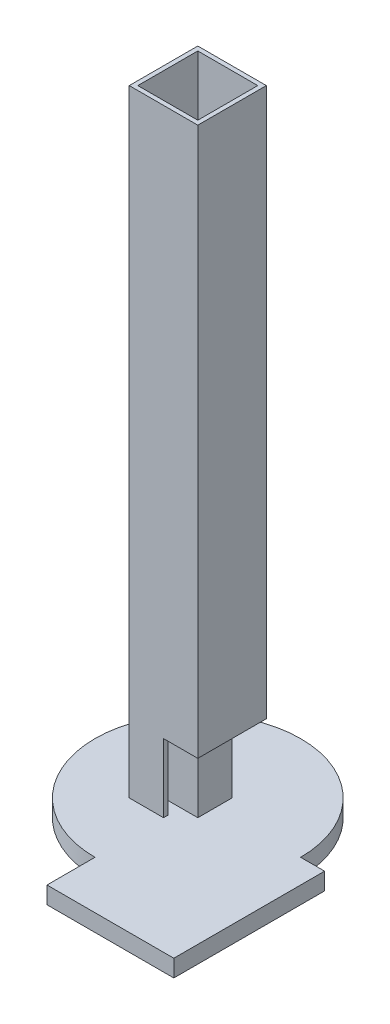
ISO-10303-21;
HEADER;
FILE_DESCRIPTION(('STEP AP214'),'2;1');
FILE_NAME('part.step','',(''),(''),'','','');
FILE_SCHEMA(('AUTOMOTIVE_DESIGN { 1 0 10303 214 1 1 1 1 }'));
ENDSEC;
DATA;
#1=APPLICATION_CONTEXT('core data for automotive mechanical design processes');
#2=APPLICATION_PROTOCOL_DEFINITION('international standard','automotive_design',2000,#1);
#3=PRODUCT_CONTEXT('',#1,'mechanical');
#4=PRODUCT('Part','Part','',(#3));
#5=PRODUCT_RELATED_PRODUCT_CATEGORY('part','',(#4));
#6=PRODUCT_DEFINITION_FORMATION('','',#4);
#7=PRODUCT_DEFINITION_CONTEXT('part definition',#1,'design');
#8=PRODUCT_DEFINITION('design','',#6,#7);
#9=PRODUCT_DEFINITION_SHAPE('','',#8);
#10=(LENGTH_UNIT() NAMED_UNIT(*) SI_UNIT(.MILLI.,.METRE.));
#11=(NAMED_UNIT(*) PLANE_ANGLE_UNIT() SI_UNIT($,.RADIAN.));
#12=(NAMED_UNIT(*) SI_UNIT($,.STERADIAN.) SOLID_ANGLE_UNIT());
#13=UNCERTAINTY_MEASURE_WITH_UNIT(LENGTH_MEASURE(1.E-05),#10,'distance_accuracy_value','');
#14=(GEOMETRIC_REPRESENTATION_CONTEXT(3) GLOBAL_UNCERTAINTY_ASSIGNED_CONTEXT((#13)) GLOBAL_UNIT_ASSIGNED_CONTEXT((#10,
#11,#12)) REPRESENTATION_CONTEXT('',''));
#15=CARTESIAN_POINT('',(0.,0.,0.));
#16=DIRECTION('',(0.,0.,1.));
#17=DIRECTION('',(1.,0.,0.));
#18=AXIS2_PLACEMENT_3D('',#15,#16,#17);
#19=CARTESIAN_POINT('',(0.,6.35,0.));
#20=DIRECTION('',(0.,1.,0.));
#21=DIRECTION('',(0.,0.,1.));
#22=AXIS2_PLACEMENT_3D('',#19,#20,#21);
#23=PLANE('',#22);
#24=DIRECTION('',(-1.,0.,0.));
#25=VECTOR('',#24,1.);
#26=CARTESIAN_POINT('',(-11.1125,6.35,11.1125));
#27=LINE('',#26,#25);
#28=CARTESIAN_POINT('',(0.,6.35,11.1125));
#29=VERTEX_POINT('',#28);
#30=CARTESIAN_POINT('',(-11.1125,6.35,11.1125));
#31=VERTEX_POINT('',#30);
#32=EDGE_CURVE('E292',#29,#31,#27,.T.);
#33=ORIENTED_EDGE('',*,*,#32,.F.);
#34=DIRECTION('',(0.,0.,1.));
#35=VECTOR('',#34,1.);
#36=CARTESIAN_POINT('',(0.,6.35,-12.7));
#37=LINE('',#36,#35);
#38=CARTESIAN_POINT('',(0.,6.35,12.7));
#39=VERTEX_POINT('',#38);
#40=EDGE_CURVE('E270',#29,#39,#37,.T.);
#41=ORIENTED_EDGE('',*,*,#40,.T.);
#42=DIRECTION('',(1.,0.,0.));
#43=VECTOR('',#42,1.);
#44=CARTESIAN_POINT('',(-12.7,6.35,12.7));
#45=LINE('',#44,#43);
#46=CARTESIAN_POINT('',(-12.7,6.35,12.7));
#47=VERTEX_POINT('',#46);
#48=EDGE_CURVE('E318',#47,#39,#45,.T.);
#49=ORIENTED_EDGE('',*,*,#48,.F.);
#50=DIRECTION('',(0.,0.,1.));
#51=VECTOR('',#50,1.);
#52=CARTESIAN_POINT('',(-12.7,6.35,12.7));
#53=LINE('',#52,#51);
#54=CARTESIAN_POINT('',(-12.7,6.35,-12.7));
#55=VERTEX_POINT('',#54);
#56=EDGE_CURVE('E326',#55,#47,#53,.T.);
#57=ORIENTED_EDGE('',*,*,#56,.F.);
#58=DIRECTION('',(-1.,0.,0.));
#59=VECTOR('',#58,1.);
#60=CARTESIAN_POINT('',(-12.7,6.35,-12.7));
#61=LINE('',#60,#59);
#62=CARTESIAN_POINT('',(0.,6.35,-12.7));
#63=VERTEX_POINT('',#62);
#64=EDGE_CURVE('E313',#63,#55,#61,.T.);
#65=ORIENTED_EDGE('',*,*,#64,.F.);
#66=CARTESIAN_POINT('',(0.,6.35,-11.1125));
#67=VERTEX_POINT('',#66);
#68=EDGE_CURVE('E266',#63,#67,#37,.T.);
#69=ORIENTED_EDGE('',*,*,#68,.T.);
#70=DIRECTION('',(-1.,0.,0.));
#71=VECTOR('',#70,1.);
#72=CARTESIAN_POINT('',(-11.1125,6.35,-11.1125));
#73=LINE('',#72,#71);
#74=CARTESIAN_POINT('',(-11.1125,6.35,-11.1125));
#75=VERTEX_POINT('',#74);
#76=EDGE_CURVE('E286',#67,#75,#73,.T.);
#77=ORIENTED_EDGE('',*,*,#76,.T.);
#78=DIRECTION('',(0.,0.,1.));
#79=VECTOR('',#78,1.);
#80=CARTESIAN_POINT('',(-11.1125,6.35,11.1125));
#81=LINE('',#80,#79);
#82=EDGE_CURVE('E288',#75,#31,#81,.T.);
#83=ORIENTED_EDGE('',*,*,#82,.T.);
#84=EDGE_LOOP('',(#33,#41,#49,#57,#65,#69,#77,#83));
#85=FACE_BOUND('',#84,.T.);
#86=CARTESIAN_POINT('',(0.,6.35,0.));
#87=DIRECTION('',(0.,1.,0.));
#88=DIRECTION('',(0.,0.,1.));
#89=AXIS2_PLACEMENT_3D('',#86,#87,#88);
#90=CIRCLE('',#89,38.1);
#91=CARTESIAN_POINT('',(38.1,6.35,0.));
#92=VERTEX_POINT('',#91);
#93=CARTESIAN_POINT('',(0.,6.35,38.1));
#94=VERTEX_POINT('',#93);
#95=EDGE_CURVE('E49',#92,#94,#90,.T.);
#96=ORIENTED_EDGE('',*,*,#95,.T.);
#97=DIRECTION('',(0.,0.,-1.));
#98=VECTOR('',#97,1.);
#99=CARTESIAN_POINT('',(0.,6.35,0.));
#100=LINE('',#99,#98);
#101=CARTESIAN_POINT('',(0.,6.35,55.88));
#102=VERTEX_POINT('',#101);
#103=EDGE_CURVE('E192',#102,#94,#100,.T.);
#104=ORIENTED_EDGE('',*,*,#103,.F.);
#105=DIRECTION('',(-1.,0.,0.));
#106=VECTOR('',#105,1.);
#107=CARTESIAN_POINT('',(0.,6.35,55.88));
#108=LINE('',#107,#106);
#109=CARTESIAN_POINT('',(46.99,6.35,55.88));
#110=VERTEX_POINT('',#109);
#111=EDGE_CURVE('E201',#110,#102,#108,.T.);
#112=ORIENTED_EDGE('',*,*,#111,.F.);
#113=DIRECTION('',(0.,0.,1.));
#114=VECTOR('',#113,1.);
#115=CARTESIAN_POINT('',(46.99,6.35,0.));
#116=LINE('',#115,#114);
#117=CARTESIAN_POINT('',(46.99,6.35,0.));
#118=VERTEX_POINT('',#117);
#119=EDGE_CURVE('E191',#118,#110,#116,.T.);
#120=ORIENTED_EDGE('',*,*,#119,.F.);
#121=DIRECTION('',(1.,0.,0.));
#122=VECTOR('',#121,1.);
#123=CARTESIAN_POINT('',(0.,6.35,0.));
#124=LINE('',#123,#122);
#125=EDGE_CURVE('E182',#92,#118,#124,.T.);
#126=ORIENTED_EDGE('',*,*,#125,.F.);
#127=EDGE_LOOP('',(#96,#104,#112,#120,#126));
#128=FACE_BOUND('',#127,.T.);
#129=DIRECTION('',(0.,0.,-1.));
#130=VECTOR('',#129,1.);
#131=CARTESIAN_POINT('',(6.35,6.35,6.35));
#132=LINE('',#131,#130);
#133=CARTESIAN_POINT('',(6.35,6.35,6.35));
#134=VERTEX_POINT('',#133);
#135=CARTESIAN_POINT('',(6.35,6.35,-6.35));
#136=VERTEX_POINT('',#135);
#137=EDGE_CURVE('E224',#134,#136,#132,.T.);
#138=ORIENTED_EDGE('',*,*,#137,.F.);
#139=DIRECTION('',(1.,0.,0.));
#140=VECTOR('',#139,1.);
#141=CARTESIAN_POINT('',(-6.35,6.35,6.35));
#142=LINE('',#141,#140);
#143=CARTESIAN_POINT('',(-6.35,6.35,6.35));
#144=VERTEX_POINT('',#143);
#145=EDGE_CURVE('E229',#144,#134,#142,.T.);
#146=ORIENTED_EDGE('',*,*,#145,.F.);
#147=DIRECTION('',(0.,0.,1.));
#148=VECTOR('',#147,1.);
#149=CARTESIAN_POINT('',(-6.35,6.35,6.35));
#150=LINE('',#149,#148);
#151=CARTESIAN_POINT('',(-6.35,6.35,-6.35));
#152=VERTEX_POINT('',#151);
#153=EDGE_CURVE('E239',#152,#144,#150,.T.);
#154=ORIENTED_EDGE('',*,*,#153,.F.);
#155=DIRECTION('',(-1.,0.,0.));
#156=VECTOR('',#155,1.);
#157=CARTESIAN_POINT('',(-6.35,6.35,-6.35));
#158=LINE('',#157,#156);
#159=EDGE_CURVE('E237',#136,#152,#158,.T.);
#160=ORIENTED_EDGE('',*,*,#159,.F.);
#161=EDGE_LOOP('',(#138,#146,#154,#160));
#162=FACE_BOUND('',#161,.T.);
#163=ADVANCED_FACE('F41',(#85,#128,#162),#23,.T.);
#164=CARTESIAN_POINT('',(0.,234.95,0.));
#165=DIRECTION('',(0.,-1.,0.));
#166=DIRECTION('',(0.,0.,-1.));
#167=AXIS2_PLACEMENT_3D('',#164,#165,#166);
#168=PLANE('',#167);
#169=DIRECTION('',(0.,0.,-1.));
#170=VECTOR('',#169,1.);
#171=CARTESIAN_POINT('',(12.7,234.95,12.7));
#172=LINE('',#171,#170);
#173=CARTESIAN_POINT('',(12.7,234.95,12.7));
#174=VERTEX_POINT('',#173);
#175=CARTESIAN_POINT('',(12.7,234.95,-12.7));
#176=VERTEX_POINT('',#175);
#177=EDGE_CURVE('E314',#174,#176,#172,.T.);
#178=ORIENTED_EDGE('',*,*,#177,.T.);
#179=DIRECTION('',(-1.,0.,0.));
#180=VECTOR('',#179,1.);
#181=CARTESIAN_POINT('',(-12.7,234.95,-12.7));
#182=LINE('',#181,#180);
#183=CARTESIAN_POINT('',(-12.7,234.95,-12.7));
#184=VERTEX_POINT('',#183);
#185=EDGE_CURVE('E317',#176,#184,#182,.T.);
#186=ORIENTED_EDGE('',*,*,#185,.T.);
#187=DIRECTION('',(0.,0.,1.));
#188=VECTOR('',#187,1.);
#189=CARTESIAN_POINT('',(-12.7,234.95,12.7));
#190=LINE('',#189,#188);
#191=CARTESIAN_POINT('',(-12.7,234.95,12.7));
#192=VERTEX_POINT('',#191);
#193=EDGE_CURVE('E320',#184,#192,#190,.T.);
#194=ORIENTED_EDGE('',*,*,#193,.T.);
#195=DIRECTION('',(1.,0.,0.));
#196=VECTOR('',#195,1.);
#197=CARTESIAN_POINT('',(-12.7,234.95,12.7));
#198=LINE('',#197,#196);
#199=EDGE_CURVE('E322',#192,#174,#198,.T.);
#200=ORIENTED_EDGE('',*,*,#199,.T.);
#201=EDGE_LOOP('',(#178,#186,#194,#200));
#202=FACE_BOUND('',#201,.T.);
#203=DIRECTION('',(0.,0.,-1.));
#204=VECTOR('',#203,1.);
#205=CARTESIAN_POINT('',(-11.1125,234.95,11.1125));
#206=LINE('',#205,#204);
#207=CARTESIAN_POINT('',(-11.1125,234.95,11.1125));
#208=VERTEX_POINT('',#207);
#209=CARTESIAN_POINT('',(-11.1125,234.95,-11.1125));
#210=VERTEX_POINT('',#209);
#211=EDGE_CURVE('E285',#208,#210,#206,.T.);
#212=ORIENTED_EDGE('',*,*,#211,.T.);
#213=DIRECTION('',(1.,0.,0.));
#214=VECTOR('',#213,1.);
#215=CARTESIAN_POINT('',(-11.1125,234.95,-11.1125));
#216=LINE('',#215,#214);
#217=CARTESIAN_POINT('',(11.1125,234.95,-11.1125));
#218=VERTEX_POINT('',#217);
#219=EDGE_CURVE('E295',#210,#218,#216,.T.);
#220=ORIENTED_EDGE('',*,*,#219,.T.);
#221=DIRECTION('',(0.,0.,-1.));
#222=VECTOR('',#221,1.);
#223=CARTESIAN_POINT('',(11.1125,234.95,11.1125));
#224=LINE('',#223,#222);
#225=CARTESIAN_POINT('',(11.1125,234.95,11.1125));
#226=VERTEX_POINT('',#225);
#227=EDGE_CURVE('E298',#226,#218,#224,.T.);
#228=ORIENTED_EDGE('',*,*,#227,.F.);
#229=DIRECTION('',(1.,0.,0.));
#230=VECTOR('',#229,1.);
#231=CARTESIAN_POINT('',(-11.1125,234.95,11.1125));
#232=LINE('',#231,#230);
#233=EDGE_CURVE('E301',#208,#226,#232,.T.);
#234=ORIENTED_EDGE('',*,*,#233,.F.);
#235=EDGE_LOOP('',(#212,#220,#228,#234));
#236=FACE_BOUND('',#235,.T.);
#237=ADVANCED_FACE('F361',(#202,#236),#168,.F.);
#238=CARTESIAN_POINT('',(0.,6.35,0.));
#239=DIRECTION('',(0.,-1.,0.));
#240=DIRECTION('',(0.,0.,-1.));
#241=AXIS2_PLACEMENT_3D('',#238,#239,#240);
#242=CYLINDRICAL_SURFACE('',#241,38.1);
#243=CARTESIAN_POINT('',(0.,0.,0.));
#244=DIRECTION('',(0.,1.,0.));
#245=DIRECTION('',(0.,0.,1.));
#246=AXIS2_PLACEMENT_3D('',#243,#244,#245);
#247=CIRCLE('',#246,38.1);
#248=CARTESIAN_POINT('',(38.1,0.,0.));
#249=VERTEX_POINT('',#248);
#250=CARTESIAN_POINT('',(0.,0.,38.1));
#251=VERTEX_POINT('',#250);
#252=EDGE_CURVE('E342',#249,#251,#247,.T.);
#253=ORIENTED_EDGE('',*,*,#252,.T.);
#254=DIRECTION('',(0.,-1.,0.));
#255=VECTOR('',#254,1.);
#256=CARTESIAN_POINT('',(0.,6.35,38.1));
#257=LINE('',#256,#255);
#258=EDGE_CURVE('E60',#251,#94,#257,.F.);
#259=ORIENTED_EDGE('',*,*,#258,.T.);
#260=ORIENTED_EDGE('',*,*,#95,.F.);
#261=DIRECTION('',(0.,-1.,0.));
#262=VECTOR('',#261,1.);
#263=CARTESIAN_POINT('',(38.1,6.35,0.));
#264=LINE('',#263,#262);
#265=EDGE_CURVE('E188',#92,#249,#264,.T.);
#266=ORIENTED_EDGE('',*,*,#265,.T.);
#267=EDGE_LOOP('',(#253,#259,#260,#266));
#268=FACE_BOUND('',#267,.T.);
#269=ADVANCED_FACE('F43',(#268),#242,.T.);
#270=CARTESIAN_POINT('',(0.,0.,0.));
#271=DIRECTION('',(0.,1.,0.));
#272=DIRECTION('',(0.,0.,1.));
#273=AXIS2_PLACEMENT_3D('',#270,#271,#272);
#274=PLANE('',#273);
#275=ORIENTED_EDGE('',*,*,#252,.F.);
#276=DIRECTION('',(1.,0.,0.));
#277=VECTOR('',#276,1.);
#278=CARTESIAN_POINT('',(0.,0.,0.));
#279=LINE('',#278,#277);
#280=CARTESIAN_POINT('',(46.99,0.,0.));
#281=VERTEX_POINT('',#280);
#282=EDGE_CURVE('E213',#249,#281,#279,.T.);
#283=ORIENTED_EDGE('',*,*,#282,.T.);
#284=DIRECTION('',(0.,0.,1.));
#285=VECTOR('',#284,1.);
#286=CARTESIAN_POINT('',(46.99,0.,0.));
#287=LINE('',#286,#285);
#288=CARTESIAN_POINT('',(46.99,0.,55.88));
#289=VERTEX_POINT('',#288);
#290=EDGE_CURVE('E199',#281,#289,#287,.T.);
#291=ORIENTED_EDGE('',*,*,#290,.T.);
#292=DIRECTION('',(-1.,0.,0.));
#293=VECTOR('',#292,1.);
#294=CARTESIAN_POINT('',(0.,0.,55.88));
#295=LINE('',#294,#293);
#296=CARTESIAN_POINT('',(0.,0.,55.88));
#297=VERTEX_POINT('',#296);
#298=EDGE_CURVE('E216',#289,#297,#295,.T.);
#299=ORIENTED_EDGE('',*,*,#298,.T.);
#300=DIRECTION('',(0.,0.,-1.));
#301=VECTOR('',#300,1.);
#302=CARTESIAN_POINT('',(0.,0.,0.));
#303=LINE('',#302,#301);
#304=EDGE_CURVE('E210',#297,#251,#303,.T.);
#305=ORIENTED_EDGE('',*,*,#304,.T.);
#306=EDGE_LOOP('',(#275,#283,#291,#299,#305));
#307=FACE_BOUND('',#306,.T.);
#308=ADVANCED_FACE('F348',(#307),#274,.F.);
#309=CARTESIAN_POINT('',(12.7,234.95,12.7));
#310=DIRECTION('',(-1.,0.,0.));
#311=DIRECTION('',(0.,0.,1.));
#312=AXIS2_PLACEMENT_3D('',#309,#310,#311);
#313=PLANE('',#312);
#314=DIRECTION('',(0.,-1.,0.));
#315=VECTOR('',#314,1.);
#316=CARTESIAN_POINT('',(12.7,234.95,12.7));
#317=LINE('',#316,#315);
#318=CARTESIAN_POINT('',(12.7,31.75,12.7));
#319=VERTEX_POINT('',#318);
#320=EDGE_CURVE('E324',#174,#319,#317,.T.);
#321=ORIENTED_EDGE('',*,*,#320,.T.);
#322=DIRECTION('',(0.,0.,1.));
#323=VECTOR('',#322,1.);
#324=CARTESIAN_POINT('',(12.7,31.75,-12.7));
#325=LINE('',#324,#323);
#326=CARTESIAN_POINT('',(12.7,31.75,-12.7));
#327=VERTEX_POINT('',#326);
#328=EDGE_CURVE('E261',#327,#319,#325,.T.);
#329=ORIENTED_EDGE('',*,*,#328,.F.);
#330=DIRECTION('',(0.,-1.,0.));
#331=VECTOR('',#330,1.);
#332=CARTESIAN_POINT('',(12.7,234.95,-12.7));
#333=LINE('',#332,#331);
#334=EDGE_CURVE('E339',#176,#327,#333,.T.);
#335=ORIENTED_EDGE('',*,*,#334,.F.);
#336=ORIENTED_EDGE('',*,*,#177,.F.);
#337=EDGE_LOOP('',(#321,#329,#335,#336));
#338=FACE_BOUND('',#337,.T.);
#339=ADVANCED_FACE('F373',(#338),#313,.F.);
#340=CARTESIAN_POINT('',(-12.7,234.95,-12.7));
#341=DIRECTION('',(0.,0.,1.));
#342=DIRECTION('',(1.,0.,0.));
#343=AXIS2_PLACEMENT_3D('',#340,#341,#342);
#344=PLANE('',#343);
#345=DIRECTION('',(-1.,0.,0.));
#346=VECTOR('',#345,1.);
#347=CARTESIAN_POINT('',(12.7,31.75,-12.7));
#348=LINE('',#347,#346);
#349=CARTESIAN_POINT('',(0.,31.75,-12.7));
#350=VERTEX_POINT('',#349);
#351=EDGE_CURVE('E254',#327,#350,#348,.T.);
#352=ORIENTED_EDGE('',*,*,#351,.T.);
#353=DIRECTION('',(0.,-1.,0.));
#354=VECTOR('',#353,1.);
#355=CARTESIAN_POINT('',(0.,6.35,-12.7));
#356=LINE('',#355,#354);
#357=EDGE_CURVE('E257',#350,#63,#356,.T.);
#358=ORIENTED_EDGE('',*,*,#357,.T.);
#359=ORIENTED_EDGE('',*,*,#64,.T.);
#360=DIRECTION('',(0.,-1.,0.));
#361=VECTOR('',#360,1.);
#362=CARTESIAN_POINT('',(-12.7,234.95,-12.7));
#363=LINE('',#362,#361);
#364=EDGE_CURVE('E336',#184,#55,#363,.T.);
#365=ORIENTED_EDGE('',*,*,#364,.F.);
#366=ORIENTED_EDGE('',*,*,#185,.F.);
#367=ORIENTED_EDGE('',*,*,#334,.T.);
#368=EDGE_LOOP('',(#352,#358,#359,#365,#366,#367));
#369=FACE_BOUND('',#368,.T.);
#370=ADVANCED_FACE('F380',(#369),#344,.F.);
#371=CARTESIAN_POINT('',(-12.7,234.95,12.7));
#372=DIRECTION('',(1.,0.,0.));
#373=DIRECTION('',(0.,0.,-1.));
#374=AXIS2_PLACEMENT_3D('',#371,#372,#373);
#375=PLANE('',#374);
#376=ORIENTED_EDGE('',*,*,#56,.T.);
#377=DIRECTION('',(0.,-1.,0.));
#378=VECTOR('',#377,1.);
#379=CARTESIAN_POINT('',(-12.7,234.95,12.7));
#380=LINE('',#379,#378);
#381=EDGE_CURVE('E333',#192,#47,#380,.T.);
#382=ORIENTED_EDGE('',*,*,#381,.F.);
#383=ORIENTED_EDGE('',*,*,#193,.F.);
#384=ORIENTED_EDGE('',*,*,#364,.T.);
#385=EDGE_LOOP('',(#376,#382,#383,#384));
#386=FACE_BOUND('',#385,.T.);
#387=ADVANCED_FACE('F409',(#386),#375,.F.);
#388=CARTESIAN_POINT('',(-12.7,234.95,12.7));
#389=DIRECTION('',(0.,0.,-1.));
#390=DIRECTION('',(-1.,0.,0.));
#391=AXIS2_PLACEMENT_3D('',#388,#389,#390);
#392=PLANE('',#391);
#393=ORIENTED_EDGE('',*,*,#48,.T.);
#394=DIRECTION('',(0.,-1.,0.));
#395=VECTOR('',#394,1.);
#396=CARTESIAN_POINT('',(0.,6.35,12.7));
#397=LINE('',#396,#395);
#398=CARTESIAN_POINT('',(0.,31.75,12.7));
#399=VERTEX_POINT('',#398);
#400=EDGE_CURVE('E258',#399,#39,#397,.T.);
#401=ORIENTED_EDGE('',*,*,#400,.F.);
#402=DIRECTION('',(-1.,0.,0.));
#403=VECTOR('',#402,1.);
#404=CARTESIAN_POINT('',(12.7,31.75,12.7));
#405=LINE('',#404,#403);
#406=EDGE_CURVE('E253',#319,#399,#405,.T.);
#407=ORIENTED_EDGE('',*,*,#406,.F.);
#408=ORIENTED_EDGE('',*,*,#320,.F.);
#409=ORIENTED_EDGE('',*,*,#199,.F.);
#410=ORIENTED_EDGE('',*,*,#381,.T.);
#411=EDGE_LOOP('',(#393,#401,#407,#408,#409,#410));
#412=FACE_BOUND('',#411,.T.);
#413=ADVANCED_FACE('F419',(#412),#392,.F.);
#414=CARTESIAN_POINT('',(-11.1125,-25.0808964237421,11.1125));
#415=DIRECTION('',(1.,0.,0.));
#416=DIRECTION('',(0.,0.,-1.));
#417=AXIS2_PLACEMENT_3D('',#414,#415,#416);
#418=PLANE('',#417);
#419=DIRECTION('',(0.,1.,0.));
#420=VECTOR('',#419,1.);
#421=CARTESIAN_POINT('',(-11.1125,-25.0808964237421,-11.1125));
#422=LINE('',#421,#420);
#423=EDGE_CURVE('E289',#75,#210,#422,.T.);
#424=ORIENTED_EDGE('',*,*,#423,.T.);
#425=ORIENTED_EDGE('',*,*,#211,.F.);
#426=DIRECTION('',(0.,1.,0.));
#427=VECTOR('',#426,1.);
#428=CARTESIAN_POINT('',(-11.1125,-25.0808964237421,11.1125));
#429=LINE('',#428,#427);
#430=EDGE_CURVE('E304',#31,#208,#429,.T.);
#431=ORIENTED_EDGE('',*,*,#430,.F.);
#432=ORIENTED_EDGE('',*,*,#82,.F.);
#433=EDGE_LOOP('',(#424,#425,#431,#432));
#434=FACE_BOUND('',#433,.T.);
#435=ADVANCED_FACE('F428',(#434),#418,.T.);
#436=CARTESIAN_POINT('',(-11.1125,-25.0808964237421,-11.1125));
#437=DIRECTION('',(0.,0.,1.));
#438=DIRECTION('',(1.,0.,0.));
#439=AXIS2_PLACEMENT_3D('',#436,#437,#438);
#440=PLANE('',#439);
#441=DIRECTION('',(0.,-1.,0.));
#442=VECTOR('',#441,1.);
#443=CARTESIAN_POINT('',(0.,-25.0808964237421,-11.1125));
#444=LINE('',#443,#442);
#445=CARTESIAN_POINT('',(0.,31.75,-11.1125));
#446=VERTEX_POINT('',#445);
#447=EDGE_CURVE('E278',#446,#67,#444,.T.);
#448=ORIENTED_EDGE('',*,*,#447,.F.);
#449=DIRECTION('',(-1.,0.,0.));
#450=VECTOR('',#449,1.);
#451=CARTESIAN_POINT('',(-11.1125,31.75,-11.1125));
#452=LINE('',#451,#450);
#453=CARTESIAN_POINT('',(11.1125,31.75,-11.1125));
#454=VERTEX_POINT('',#453);
#455=EDGE_CURVE('E283',#454,#446,#452,.T.);
#456=ORIENTED_EDGE('',*,*,#455,.F.);
#457=DIRECTION('',(0.,1.,0.));
#458=VECTOR('',#457,1.);
#459=CARTESIAN_POINT('',(11.1125,-25.0808964237421,-11.1125));
#460=LINE('',#459,#458);
#461=EDGE_CURVE('E309',#454,#218,#460,.T.);
#462=ORIENTED_EDGE('',*,*,#461,.T.);
#463=ORIENTED_EDGE('',*,*,#219,.F.);
#464=ORIENTED_EDGE('',*,*,#423,.F.);
#465=ORIENTED_EDGE('',*,*,#76,.F.);
#466=EDGE_LOOP('',(#448,#456,#462,#463,#464,#465));
#467=FACE_BOUND('',#466,.T.);
#468=ADVANCED_FACE('F443',(#467),#440,.T.);
#469=CARTESIAN_POINT('',(11.1125,-25.0808964237421,11.1125));
#470=DIRECTION('',(1.,0.,0.));
#471=DIRECTION('',(0.,0.,-1.));
#472=AXIS2_PLACEMENT_3D('',#469,#470,#471);
#473=PLANE('',#472);
#474=ORIENTED_EDGE('',*,*,#461,.F.);
#475=DIRECTION('',(0.,0.,1.));
#476=VECTOR('',#475,1.);
#477=CARTESIAN_POINT('',(11.1125,31.75,11.1125));
#478=LINE('',#477,#476);
#479=CARTESIAN_POINT('',(11.1125,31.75,11.1125));
#480=VERTEX_POINT('',#479);
#481=EDGE_CURVE('E280',#454,#480,#478,.T.);
#482=ORIENTED_EDGE('',*,*,#481,.T.);
#483=DIRECTION('',(0.,1.,0.));
#484=VECTOR('',#483,1.);
#485=CARTESIAN_POINT('',(11.1125,-25.0808964237421,11.1125));
#486=LINE('',#485,#484);
#487=EDGE_CURVE('E307',#480,#226,#486,.T.);
#488=ORIENTED_EDGE('',*,*,#487,.T.);
#489=ORIENTED_EDGE('',*,*,#227,.T.);
#490=EDGE_LOOP('',(#474,#482,#488,#489));
#491=FACE_BOUND('',#490,.T.);
#492=ADVANCED_FACE('F452',(#491),#473,.F.);
#493=CARTESIAN_POINT('',(-11.1125,-25.0808964237421,11.1125));
#494=DIRECTION('',(0.,0.,1.));
#495=DIRECTION('',(1.,0.,0.));
#496=AXIS2_PLACEMENT_3D('',#493,#494,#495);
#497=PLANE('',#496);
#498=DIRECTION('',(-1.,0.,0.));
#499=VECTOR('',#498,1.);
#500=CARTESIAN_POINT('',(-11.1125,31.75,11.1125));
#501=LINE('',#500,#499);
#502=CARTESIAN_POINT('',(0.,31.75,11.1125));
#503=VERTEX_POINT('',#502);
#504=EDGE_CURVE('E11',#480,#503,#501,.T.);
#505=ORIENTED_EDGE('',*,*,#504,.T.);
#506=DIRECTION('',(0.,-1.,0.));
#507=VECTOR('',#506,1.);
#508=CARTESIAN_POINT('',(0.,-25.0808964237421,11.1125));
#509=LINE('',#508,#507);
#510=EDGE_CURVE('E269',#503,#29,#509,.T.);
#511=ORIENTED_EDGE('',*,*,#510,.T.);
#512=ORIENTED_EDGE('',*,*,#32,.T.);
#513=ORIENTED_EDGE('',*,*,#430,.T.);
#514=ORIENTED_EDGE('',*,*,#233,.T.);
#515=ORIENTED_EDGE('',*,*,#487,.F.);
#516=EDGE_LOOP('',(#505,#511,#512,#513,#514,#515));
#517=FACE_BOUND('',#516,.T.);
#518=ADVANCED_FACE('F462',(#517),#497,.F.);
#519=CARTESIAN_POINT('',(0.,6.35,-12.7));
#520=DIRECTION('',(-1.,0.,0.));
#521=DIRECTION('',(0.,-1.,0.));
#522=AXIS2_PLACEMENT_3D('',#519,#520,#521);
#523=PLANE('',#522);
#524=DIRECTION('',(0.,0.,1.));
#525=VECTOR('',#524,1.);
#526=CARTESIAN_POINT('',(0.,31.75,-12.7));
#527=LINE('',#526,#525);
#528=EDGE_CURVE('E274',#503,#399,#527,.T.);
#529=ORIENTED_EDGE('',*,*,#528,.T.);
#530=ORIENTED_EDGE('',*,*,#400,.T.);
#531=ORIENTED_EDGE('',*,*,#40,.F.);
#532=ORIENTED_EDGE('',*,*,#510,.F.);
#533=EDGE_LOOP('',(#529,#530,#531,#532));
#534=FACE_BOUND('',#533,.T.);
#535=ADVANCED_FACE('F472',(#534),#523,.F.);
#536=ORIENTED_EDGE('',*,*,#447,.T.);
#537=ORIENTED_EDGE('',*,*,#68,.F.);
#538=ORIENTED_EDGE('',*,*,#357,.F.);
#539=EDGE_CURVE('E271',#350,#446,#527,.T.);
#540=ORIENTED_EDGE('',*,*,#539,.T.);
#541=EDGE_LOOP('',(#536,#537,#538,#540));
#542=FACE_BOUND('',#541,.T.);
#543=ADVANCED_FACE('F482',(#542),#523,.F.);
#544=CARTESIAN_POINT('',(12.7,31.75,-12.7));
#545=DIRECTION('',(0.,1.,0.));
#546=DIRECTION('',(0.,0.,1.));
#547=AXIS2_PLACEMENT_3D('',#544,#545,#546);
#548=PLANE('',#547);
#549=ORIENTED_EDGE('',*,*,#455,.T.);
#550=ORIENTED_EDGE('',*,*,#539,.F.);
#551=ORIENTED_EDGE('',*,*,#351,.F.);
#552=ORIENTED_EDGE('',*,*,#328,.T.);
#553=ORIENTED_EDGE('',*,*,#406,.T.);
#554=ORIENTED_EDGE('',*,*,#528,.F.);
#555=ORIENTED_EDGE('',*,*,#504,.F.);
#556=ORIENTED_EDGE('',*,*,#481,.F.);
#557=EDGE_LOOP('',(#549,#550,#551,#552,#553,#554,#555,#556));
#558=FACE_BOUND('',#557,.T.);
#559=ADVANCED_FACE('F492',(#558),#548,.F.);
#560=CARTESIAN_POINT('',(6.35,209.55,6.35));
#561=DIRECTION('',(-1.,0.,0.));
#562=DIRECTION('',(0.,0.,1.));
#563=AXIS2_PLACEMENT_3D('',#560,#561,#562);
#564=PLANE('',#563);
#565=ORIENTED_EDGE('',*,*,#137,.T.);
#566=DIRECTION('',(0.,-1.,0.));
#567=VECTOR('',#566,1.);
#568=CARTESIAN_POINT('',(6.35,209.55,-6.35));
#569=LINE('',#568,#567);
#570=CARTESIAN_POINT('',(6.35,209.55,-6.35));
#571=VERTEX_POINT('',#570);
#572=EDGE_CURVE('E250',#571,#136,#569,.T.);
#573=ORIENTED_EDGE('',*,*,#572,.F.);
#574=DIRECTION('',(0.,0.,-1.));
#575=VECTOR('',#574,1.);
#576=CARTESIAN_POINT('',(6.35,209.55,6.35));
#577=LINE('',#576,#575);
#578=CARTESIAN_POINT('',(6.35,209.55,6.35));
#579=VERTEX_POINT('',#578);
#580=EDGE_CURVE('E225',#579,#571,#577,.T.);
#581=ORIENTED_EDGE('',*,*,#580,.F.);
#582=DIRECTION('',(0.,-1.,0.));
#583=VECTOR('',#582,1.);
#584=CARTESIAN_POINT('',(6.35,209.55,6.35));
#585=LINE('',#584,#583);
#586=EDGE_CURVE('E235',#579,#134,#585,.T.);
#587=ORIENTED_EDGE('',*,*,#586,.T.);
#588=EDGE_LOOP('',(#565,#573,#581,#587));
#589=FACE_BOUND('',#588,.T.);
#590=ADVANCED_FACE('F501',(#589),#564,.F.);
#591=CARTESIAN_POINT('',(-6.35,209.55,-6.35));
#592=DIRECTION('',(0.,0.,1.));
#593=DIRECTION('',(1.,0.,0.));
#594=AXIS2_PLACEMENT_3D('',#591,#592,#593);
#595=PLANE('',#594);
#596=ORIENTED_EDGE('',*,*,#159,.T.);
#597=DIRECTION('',(0.,-1.,0.));
#598=VECTOR('',#597,1.);
#599=CARTESIAN_POINT('',(-6.35,209.55,-6.35));
#600=LINE('',#599,#598);
#601=CARTESIAN_POINT('',(-6.35,209.55,-6.35));
#602=VERTEX_POINT('',#601);
#603=EDGE_CURVE('E247',#602,#152,#600,.T.);
#604=ORIENTED_EDGE('',*,*,#603,.F.);
#605=DIRECTION('',(-1.,0.,0.));
#606=VECTOR('',#605,1.);
#607=CARTESIAN_POINT('',(-6.35,209.55,-6.35));
#608=LINE('',#607,#606);
#609=EDGE_CURVE('E228',#571,#602,#608,.T.);
#610=ORIENTED_EDGE('',*,*,#609,.F.);
#611=ORIENTED_EDGE('',*,*,#572,.T.);
#612=EDGE_LOOP('',(#596,#604,#610,#611));
#613=FACE_BOUND('',#612,.T.);
#614=ADVANCED_FACE('F522',(#613),#595,.F.);
#615=CARTESIAN_POINT('',(-6.35,209.55,6.35));
#616=DIRECTION('',(1.,0.,0.));
#617=DIRECTION('',(0.,0.,-1.));
#618=AXIS2_PLACEMENT_3D('',#615,#616,#617);
#619=PLANE('',#618);
#620=ORIENTED_EDGE('',*,*,#153,.T.);
#621=DIRECTION('',(0.,-1.,0.));
#622=VECTOR('',#621,1.);
#623=CARTESIAN_POINT('',(-6.35,209.55,6.35));
#624=LINE('',#623,#622);
#625=CARTESIAN_POINT('',(-6.35,209.55,6.35));
#626=VERTEX_POINT('',#625);
#627=EDGE_CURVE('E245',#626,#144,#624,.T.);
#628=ORIENTED_EDGE('',*,*,#627,.F.);
#629=DIRECTION('',(0.,0.,1.));
#630=VECTOR('',#629,1.);
#631=CARTESIAN_POINT('',(-6.35,209.55,6.35));
#632=LINE('',#631,#630);
#633=EDGE_CURVE('E231',#602,#626,#632,.T.);
#634=ORIENTED_EDGE('',*,*,#633,.F.);
#635=ORIENTED_EDGE('',*,*,#603,.T.);
#636=EDGE_LOOP('',(#620,#628,#634,#635));
#637=FACE_BOUND('',#636,.T.);
#638=ADVANCED_FACE('F532',(#637),#619,.F.);
#639=CARTESIAN_POINT('',(-6.35,209.55,6.35));
#640=DIRECTION('',(0.,0.,-1.));
#641=DIRECTION('',(-1.,0.,0.));
#642=AXIS2_PLACEMENT_3D('',#639,#640,#641);
#643=PLANE('',#642);
#644=ORIENTED_EDGE('',*,*,#145,.T.);
#645=ORIENTED_EDGE('',*,*,#586,.F.);
#646=DIRECTION('',(1.,0.,0.));
#647=VECTOR('',#646,1.);
#648=CARTESIAN_POINT('',(-6.35,209.55,6.35));
#649=LINE('',#648,#647);
#650=EDGE_CURVE('E233',#626,#579,#649,.T.);
#651=ORIENTED_EDGE('',*,*,#650,.F.);
#652=ORIENTED_EDGE('',*,*,#627,.T.);
#653=EDGE_LOOP('',(#644,#645,#651,#652));
#654=FACE_BOUND('',#653,.T.);
#655=ADVANCED_FACE('F542',(#654),#643,.F.);
#656=CARTESIAN_POINT('',(0.,209.55,0.));
#657=DIRECTION('',(0.,-1.,0.));
#658=DIRECTION('',(0.,0.,-1.));
#659=AXIS2_PLACEMENT_3D('',#656,#657,#658);
#660=PLANE('',#659);
#661=ORIENTED_EDGE('',*,*,#580,.T.);
#662=ORIENTED_EDGE('',*,*,#609,.T.);
#663=ORIENTED_EDGE('',*,*,#633,.T.);
#664=ORIENTED_EDGE('',*,*,#650,.T.);
#665=EDGE_LOOP('',(#661,#662,#663,#664));
#666=FACE_BOUND('',#665,.T.);
#667=ADVANCED_FACE('F551',(#666),#660,.F.);
#668=CARTESIAN_POINT('',(0.,6.35,0.));
#669=DIRECTION('',(-1.,0.,0.));
#670=DIRECTION('',(0.,0.,1.));
#671=AXIS2_PLACEMENT_3D('',#668,#669,#670);
#672=PLANE('',#671);
#673=ORIENTED_EDGE('',*,*,#258,.F.);
#674=ORIENTED_EDGE('',*,*,#304,.F.);
#675=DIRECTION('',(0.,-1.,0.));
#676=VECTOR('',#675,1.);
#677=CARTESIAN_POINT('',(0.,6.35,55.88));
#678=LINE('',#677,#676);
#679=EDGE_CURVE('E219',#102,#297,#678,.T.);
#680=ORIENTED_EDGE('',*,*,#679,.F.);
#681=ORIENTED_EDGE('',*,*,#103,.T.);
#682=EDGE_LOOP('',(#673,#674,#680,#681));
#683=FACE_BOUND('',#682,.T.);
#684=ADVANCED_FACE('F347',(#683),#672,.T.);
#685=CARTESIAN_POINT('',(0.,6.35,0.));
#686=DIRECTION('',(0.,0.,-1.));
#687=DIRECTION('',(-1.,0.,0.));
#688=AXIS2_PLACEMENT_3D('',#685,#686,#687);
#689=PLANE('',#688);
#690=ORIENTED_EDGE('',*,*,#265,.F.);
#691=ORIENTED_EDGE('',*,*,#125,.T.);
#692=DIRECTION('',(0.,-1.,0.));
#693=VECTOR('',#692,1.);
#694=CARTESIAN_POINT('',(46.99,6.35,0.));
#695=LINE('',#694,#693);
#696=EDGE_CURVE('E186',#118,#281,#695,.T.);
#697=ORIENTED_EDGE('',*,*,#696,.T.);
#698=ORIENTED_EDGE('',*,*,#282,.F.);
#699=EDGE_LOOP('',(#690,#691,#697,#698));
#700=FACE_BOUND('',#699,.T.);
#701=ADVANCED_FACE('F184',(#700),#689,.T.);
#702=CARTESIAN_POINT('',(0.,6.35,55.88));
#703=DIRECTION('',(0.,0.,1.));
#704=DIRECTION('',(1.,0.,0.));
#705=AXIS2_PLACEMENT_3D('',#702,#703,#704);
#706=PLANE('',#705);
#707=ORIENTED_EDGE('',*,*,#298,.F.);
#708=DIRECTION('',(0.,-1.,0.));
#709=VECTOR('',#708,1.);
#710=CARTESIAN_POINT('',(46.99,6.35,55.88));
#711=LINE('',#710,#709);
#712=EDGE_CURVE('E200',#110,#289,#711,.T.);
#713=ORIENTED_EDGE('',*,*,#712,.F.);
#714=ORIENTED_EDGE('',*,*,#111,.T.);
#715=ORIENTED_EDGE('',*,*,#679,.T.);
#716=EDGE_LOOP('',(#707,#713,#714,#715));
#717=FACE_BOUND('',#716,.T.);
#718=ADVANCED_FACE('F351',(#717),#706,.T.);
#719=CARTESIAN_POINT('',(46.99,6.35,0.));
#720=DIRECTION('',(1.,0.,0.));
#721=DIRECTION('',(0.,0.,-1.));
#722=AXIS2_PLACEMENT_3D('',#719,#720,#721);
#723=PLANE('',#722);
#724=ORIENTED_EDGE('',*,*,#290,.F.);
#725=ORIENTED_EDGE('',*,*,#696,.F.);
#726=ORIENTED_EDGE('',*,*,#119,.T.);
#727=ORIENTED_EDGE('',*,*,#712,.T.);
#728=EDGE_LOOP('',(#724,#725,#726,#727));
#729=FACE_BOUND('',#728,.T.);
#730=ADVANCED_FACE('F196',(#729),#723,.T.);
#731=CLOSED_SHELL('',(#163,#237,#269,#308,#339,#370,#387,#413,#435,#468,#492,#518,#535,#543,
#559,#590,#614,#638,#655,#667,#684,#701,#718,#730));
#732=MANIFOLD_SOLID_BREP('B2',#731);
#733=ADVANCED_BREP_SHAPE_REPRESENTATION('',(#18,#732),#14);
#734=SHAPE_DEFINITION_REPRESENTATION(#9,#733);
ENDSEC;
END-ISO-10303-21;
